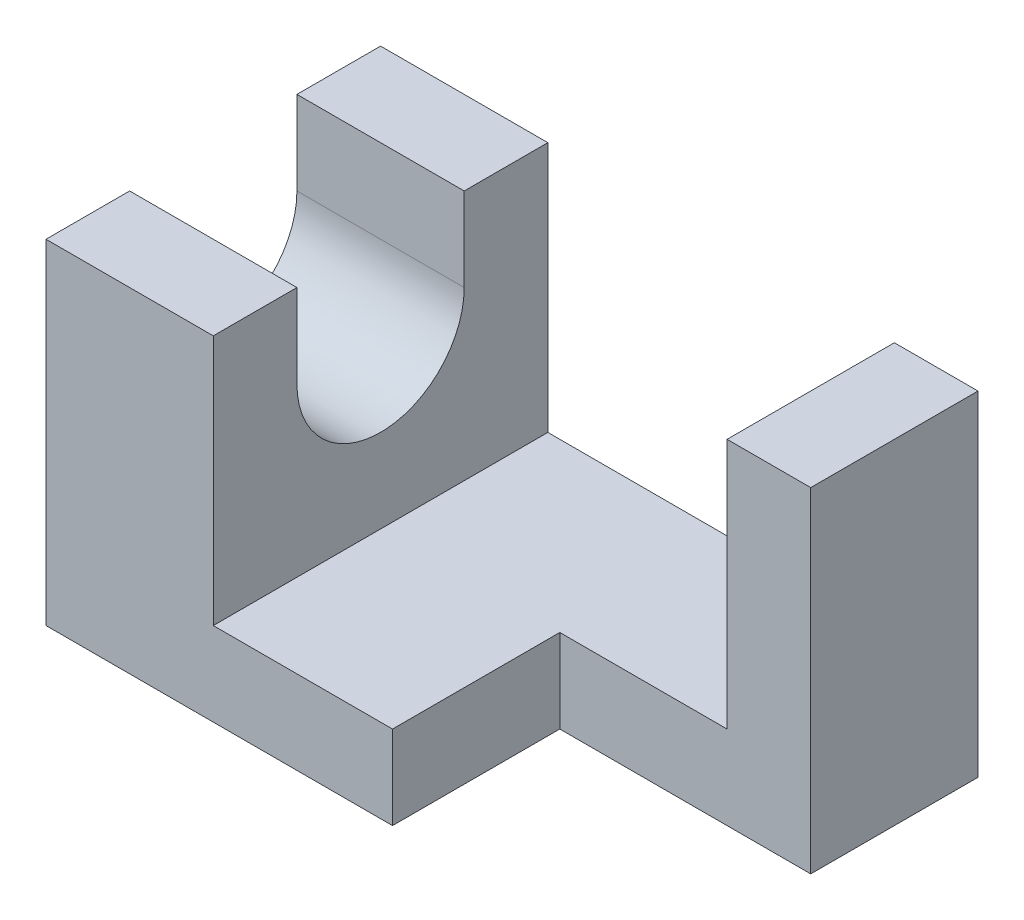
ISO-10303-21;
HEADER;
FILE_DESCRIPTION(('STEP AP214'),'2;1');
FILE_NAME('part.step','',(''),(''),'','','');
FILE_SCHEMA(('AUTOMOTIVE_DESIGN { 1 0 10303 214 1 1 1 1 }'));
ENDSEC;
DATA;
#1=APPLICATION_CONTEXT('core data for automotive mechanical design processes');
#2=APPLICATION_PROTOCOL_DEFINITION('international standard','automotive_design',2000,#1);
#3=PRODUCT_CONTEXT('',#1,'mechanical');
#4=PRODUCT('Part','Part','',(#3));
#5=PRODUCT_RELATED_PRODUCT_CATEGORY('part','',(#4));
#6=PRODUCT_DEFINITION_FORMATION('','',#4);
#7=PRODUCT_DEFINITION_CONTEXT('part definition',#1,'design');
#8=PRODUCT_DEFINITION('design','',#6,#7);
#9=PRODUCT_DEFINITION_SHAPE('','',#8);
#10=(LENGTH_UNIT() NAMED_UNIT(*) SI_UNIT(.MILLI.,.METRE.));
#11=(NAMED_UNIT(*) PLANE_ANGLE_UNIT() SI_UNIT($,.RADIAN.));
#12=(NAMED_UNIT(*) SI_UNIT($,.STERADIAN.) SOLID_ANGLE_UNIT());
#13=UNCERTAINTY_MEASURE_WITH_UNIT(LENGTH_MEASURE(1.E-05),#10,'distance_accuracy_value','');
#14=(GEOMETRIC_REPRESENTATION_CONTEXT(3) GLOBAL_UNCERTAINTY_ASSIGNED_CONTEXT((#13)) GLOBAL_UNIT_ASSIGNED_CONTEXT((#10,
#11,#12)) REPRESENTATION_CONTEXT('',''));
#15=CARTESIAN_POINT('',(0.,0.,0.));
#16=DIRECTION('',(0.,0.,1.));
#17=DIRECTION('',(1.,0.,0.));
#18=AXIS2_PLACEMENT_3D('',#15,#16,#17);
#19=CARTESIAN_POINT('',(0.,28.,0.));
#20=DIRECTION('',(0.,1.,0.));
#21=DIRECTION('',(0.,0.,1.));
#22=AXIS2_PLACEMENT_3D('',#19,#20,#21);
#23=PLANE('',#22);
#24=DIRECTION('',(0.,0.,-1.));
#25=VECTOR('',#24,1.);
#26=CARTESIAN_POINT('',(-29.,28.,0.));
#27=LINE('',#26,#25);
#28=CARTESIAN_POINT('',(-29.,28.,-21.));
#29=VERTEX_POINT('',#28);
#30=CARTESIAN_POINT('',(-29.,28.,-28.));
#31=VERTEX_POINT('',#30);
#32=EDGE_CURVE('E146',#29,#31,#27,.T.);
#33=ORIENTED_EDGE('',*,*,#32,.F.);
#34=DIRECTION('',(1.,0.,0.));
#35=VECTOR('',#34,1.);
#36=CARTESIAN_POINT('',(0.,28.,-21.));
#37=LINE('',#36,#35);
#38=CARTESIAN_POINT('',(-15.,28.,-21.));
#39=VERTEX_POINT('',#38);
#40=EDGE_CURVE('E200',#29,#39,#37,.T.);
#41=ORIENTED_EDGE('',*,*,#40,.T.);
#42=DIRECTION('',(0.,0.,1.));
#43=VECTOR('',#42,1.);
#44=CARTESIAN_POINT('',(-15.,28.,0.));
#45=LINE('',#44,#43);
#46=CARTESIAN_POINT('',(-15.,28.,-28.));
#47=VERTEX_POINT('',#46);
#48=EDGE_CURVE('E139',#47,#39,#45,.T.);
#49=ORIENTED_EDGE('',*,*,#48,.F.);
#50=DIRECTION('',(1.,0.,0.));
#51=VECTOR('',#50,1.);
#52=CARTESIAN_POINT('',(0.,28.,-28.));
#53=LINE('',#52,#51);
#54=EDGE_CURVE('E142',#31,#47,#53,.T.);
#55=ORIENTED_EDGE('',*,*,#54,.F.);
#56=EDGE_LOOP('',(#33,#41,#49,#55));
#57=FACE_BOUND('',#56,.T.);
#58=ADVANCED_FACE('F43',(#57),#23,.T.);
#59=CARTESIAN_POINT('',(0.,7.,-28.));
#60=DIRECTION('',(0.,0.,-1.));
#61=DIRECTION('',(-1.,0.,0.));
#62=AXIS2_PLACEMENT_3D('',#59,#60,#61);
#63=PLANE('',#62);
#64=DIRECTION('',(1.,0.,0.));
#65=VECTOR('',#64,1.);
#66=CARTESIAN_POINT('',(0.,0.,-28.));
#67=LINE('',#66,#65);
#68=CARTESIAN_POINT('',(-29.,0.,-28.));
#69=VERTEX_POINT('',#68);
#70=CARTESIAN_POINT('',(21.,0.,-28.));
#71=VERTEX_POINT('',#70);
#72=EDGE_CURVE('E165',#69,#71,#67,.T.);
#73=ORIENTED_EDGE('',*,*,#72,.F.);
#74=DIRECTION('',(0.,-1.,0.));
#75=VECTOR('',#74,1.);
#76=CARTESIAN_POINT('',(-29.,28.,-28.));
#77=LINE('',#76,#75);
#78=EDGE_CURVE('E159',#31,#69,#77,.T.);
#79=ORIENTED_EDGE('',*,*,#78,.F.);
#80=ORIENTED_EDGE('',*,*,#54,.T.);
#81=DIRECTION('',(0.,-1.,0.));
#82=VECTOR('',#81,1.);
#83=CARTESIAN_POINT('',(-15.,28.,-28.));
#84=LINE('',#83,#82);
#85=CARTESIAN_POINT('',(-15.,7.,-28.));
#86=VERTEX_POINT('',#85);
#87=EDGE_CURVE('E162',#47,#86,#84,.T.);
#88=ORIENTED_EDGE('',*,*,#87,.T.);
#89=DIRECTION('',(1.,0.,0.));
#90=VECTOR('',#89,1.);
#91=CARTESIAN_POINT('',(0.,7.,-28.));
#92=LINE('',#91,#90);
#93=CARTESIAN_POINT('',(14.,7.,-28.));
#94=VERTEX_POINT('',#93);
#95=EDGE_CURVE('E166',#86,#94,#92,.T.);
#96=ORIENTED_EDGE('',*,*,#95,.T.);
#97=DIRECTION('',(0.,-1.,0.));
#98=VECTOR('',#97,1.);
#99=CARTESIAN_POINT('',(14.,28.,-28.));
#100=LINE('',#99,#98);
#101=CARTESIAN_POINT('',(14.,28.,-28.));
#102=VERTEX_POINT('',#101);
#103=EDGE_CURVE('E135',#102,#94,#100,.T.);
#104=ORIENTED_EDGE('',*,*,#103,.F.);
#105=DIRECTION('',(1.,0.,0.));
#106=VECTOR('',#105,1.);
#107=CARTESIAN_POINT('',(0.,28.,-28.));
#108=LINE('',#107,#106);
#109=CARTESIAN_POINT('',(21.,28.,-28.));
#110=VERTEX_POINT('',#109);
#111=EDGE_CURVE('E112',#102,#110,#108,.T.);
#112=ORIENTED_EDGE('',*,*,#111,.T.);
#113=DIRECTION('',(0.,-1.,0.));
#114=VECTOR('',#113,1.);
#115=CARTESIAN_POINT('',(21.,28.,-28.));
#116=LINE('',#115,#114);
#117=EDGE_CURVE('E124',#110,#71,#116,.T.);
#118=ORIENTED_EDGE('',*,*,#117,.T.);
#119=EDGE_LOOP('',(#73,#79,#80,#88,#96,#104,#112,#118));
#120=FACE_BOUND('',#119,.T.);
#121=ADVANCED_FACE('F45',(#120),#63,.T.);
#122=CARTESIAN_POINT('',(0.,7.,0.));
#123=DIRECTION('',(0.,0.,1.));
#124=DIRECTION('',(1.,0.,0.));
#125=AXIS2_PLACEMENT_3D('',#122,#123,#124);
#126=PLANE('',#125);
#127=DIRECTION('',(-1.,0.,0.));
#128=VECTOR('',#127,1.);
#129=CARTESIAN_POINT('',(0.,0.,0.));
#130=LINE('',#129,#128);
#131=CARTESIAN_POINT('',(0.,0.,0.));
#132=VERTEX_POINT('',#131);
#133=CARTESIAN_POINT('',(-29.,0.,0.));
#134=VERTEX_POINT('',#133);
#135=EDGE_CURVE('E187',#132,#134,#130,.T.);
#136=ORIENTED_EDGE('',*,*,#135,.F.);
#137=DIRECTION('',(0.,-1.,0.));
#138=VECTOR('',#137,1.);
#139=CARTESIAN_POINT('',(0.,7.,0.));
#140=LINE('',#139,#138);
#141=CARTESIAN_POINT('',(0.,7.,0.));
#142=VERTEX_POINT('',#141);
#143=EDGE_CURVE('E197',#142,#132,#140,.T.);
#144=ORIENTED_EDGE('',*,*,#143,.F.);
#145=DIRECTION('',(-1.,0.,0.));
#146=VECTOR('',#145,1.);
#147=CARTESIAN_POINT('',(0.,7.,0.));
#148=LINE('',#147,#146);
#149=CARTESIAN_POINT('',(-15.,7.,0.));
#150=VERTEX_POINT('',#149);
#151=EDGE_CURVE('E172',#142,#150,#148,.T.);
#152=ORIENTED_EDGE('',*,*,#151,.T.);
#153=DIRECTION('',(0.,-1.,0.));
#154=VECTOR('',#153,1.);
#155=CARTESIAN_POINT('',(-15.,28.,0.));
#156=LINE('',#155,#154);
#157=CARTESIAN_POINT('',(-15.,28.,0.));
#158=VERTEX_POINT('',#157);
#159=EDGE_CURVE('E151',#158,#150,#156,.T.);
#160=ORIENTED_EDGE('',*,*,#159,.F.);
#161=DIRECTION('',(-1.,0.,0.));
#162=VECTOR('',#161,1.);
#163=CARTESIAN_POINT('',(0.,28.,0.));
#164=LINE('',#163,#162);
#165=CARTESIAN_POINT('',(-29.,28.,0.));
#166=VERTEX_POINT('',#165);
#167=EDGE_CURVE('E148',#158,#166,#164,.T.);
#168=ORIENTED_EDGE('',*,*,#167,.T.);
#169=DIRECTION('',(0.,-1.,0.));
#170=VECTOR('',#169,1.);
#171=CARTESIAN_POINT('',(-29.,28.,0.));
#172=LINE('',#171,#170);
#173=EDGE_CURVE('E156',#166,#134,#172,.T.);
#174=ORIENTED_EDGE('',*,*,#173,.T.);
#175=EDGE_LOOP('',(#136,#144,#152,#160,#168,#174));
#176=FACE_BOUND('',#175,.T.);
#177=ADVANCED_FACE('F218',(#176),#126,.T.);
#178=CARTESIAN_POINT('',(0.,7.,0.));
#179=DIRECTION('',(1.,0.,0.));
#180=DIRECTION('',(0.,0.,-1.));
#181=AXIS2_PLACEMENT_3D('',#178,#179,#180);
#182=PLANE('',#181);
#183=DIRECTION('',(0.,0.,1.));
#184=VECTOR('',#183,1.);
#185=CARTESIAN_POINT('',(0.,0.,0.));
#186=LINE('',#185,#184);
#187=CARTESIAN_POINT('',(0.,0.,-14.));
#188=VERTEX_POINT('',#187);
#189=EDGE_CURVE('E190',#188,#132,#186,.T.);
#190=ORIENTED_EDGE('',*,*,#189,.F.);
#191=DIRECTION('',(0.,-1.,0.));
#192=VECTOR('',#191,1.);
#193=CARTESIAN_POINT('',(0.,7.,-14.));
#194=LINE('',#193,#192);
#195=CARTESIAN_POINT('',(0.,7.,-14.));
#196=VERTEX_POINT('',#195);
#197=EDGE_CURVE('E184',#196,#188,#194,.T.);
#198=ORIENTED_EDGE('',*,*,#197,.F.);
#199=DIRECTION('',(0.,0.,1.));
#200=VECTOR('',#199,1.);
#201=CARTESIAN_POINT('',(0.,7.,0.));
#202=LINE('',#201,#200);
#203=EDGE_CURVE('E175',#196,#142,#202,.T.);
#204=ORIENTED_EDGE('',*,*,#203,.T.);
#205=ORIENTED_EDGE('',*,*,#143,.T.);
#206=EDGE_LOOP('',(#190,#198,#204,#205));
#207=FACE_BOUND('',#206,.T.);
#208=ADVANCED_FACE('F250',(#207),#182,.T.);
#209=CARTESIAN_POINT('',(0.,7.,-14.));
#210=DIRECTION('',(0.,0.,1.));
#211=DIRECTION('',(1.,0.,0.));
#212=AXIS2_PLACEMENT_3D('',#209,#210,#211);
#213=PLANE('',#212);
#214=DIRECTION('',(-1.,0.,0.));
#215=VECTOR('',#214,1.);
#216=CARTESIAN_POINT('',(0.,0.,-14.));
#217=LINE('',#216,#215);
#218=CARTESIAN_POINT('',(21.,0.,-14.));
#219=VERTEX_POINT('',#218);
#220=EDGE_CURVE('E169',#219,#188,#217,.T.);
#221=ORIENTED_EDGE('',*,*,#220,.F.);
#222=DIRECTION('',(0.,-1.,0.));
#223=VECTOR('',#222,1.);
#224=CARTESIAN_POINT('',(21.,28.,-14.));
#225=LINE('',#224,#223);
#226=CARTESIAN_POINT('',(21.,28.,-14.));
#227=VERTEX_POINT('',#226);
#228=EDGE_CURVE('E129',#227,#219,#225,.T.);
#229=ORIENTED_EDGE('',*,*,#228,.F.);
#230=DIRECTION('',(-1.,0.,0.));
#231=VECTOR('',#230,1.);
#232=CARTESIAN_POINT('',(0.,28.,-14.));
#233=LINE('',#232,#231);
#234=CARTESIAN_POINT('',(14.,28.,-14.));
#235=VERTEX_POINT('',#234);
#236=EDGE_CURVE('E118',#227,#235,#233,.T.);
#237=ORIENTED_EDGE('',*,*,#236,.T.);
#238=DIRECTION('',(0.,-1.,0.));
#239=VECTOR('',#238,1.);
#240=CARTESIAN_POINT('',(14.,28.,-14.));
#241=LINE('',#240,#239);
#242=CARTESIAN_POINT('',(14.,7.,-14.));
#243=VERTEX_POINT('',#242);
#244=EDGE_CURVE('E132',#235,#243,#241,.T.);
#245=ORIENTED_EDGE('',*,*,#244,.T.);
#246=DIRECTION('',(-1.,0.,0.));
#247=VECTOR('',#246,1.);
#248=CARTESIAN_POINT('',(0.,7.,-14.));
#249=LINE('',#248,#247);
#250=EDGE_CURVE('E178',#243,#196,#249,.T.);
#251=ORIENTED_EDGE('',*,*,#250,.T.);
#252=ORIENTED_EDGE('',*,*,#197,.T.);
#253=EDGE_LOOP('',(#221,#229,#237,#245,#251,#252));
#254=FACE_BOUND('',#253,.T.);
#255=ADVANCED_FACE('F246',(#254),#213,.T.);
#256=CARTESIAN_POINT('',(0.,7.,0.));
#257=DIRECTION('',(0.,1.,0.));
#258=DIRECTION('',(0.,0.,1.));
#259=AXIS2_PLACEMENT_3D('',#256,#257,#258);
#260=PLANE('',#259);
#261=ORIENTED_EDGE('',*,*,#95,.F.);
#262=DIRECTION('',(0.,0.,1.));
#263=VECTOR('',#262,1.);
#264=CARTESIAN_POINT('',(-15.,7.,0.));
#265=LINE('',#264,#263);
#266=EDGE_CURVE('E168',#86,#150,#265,.T.);
#267=ORIENTED_EDGE('',*,*,#266,.T.);
#268=ORIENTED_EDGE('',*,*,#151,.F.);
#269=ORIENTED_EDGE('',*,*,#203,.F.);
#270=ORIENTED_EDGE('',*,*,#250,.F.);
#271=DIRECTION('',(0.,0.,1.));
#272=VECTOR('',#271,1.);
#273=CARTESIAN_POINT('',(14.,7.,0.));
#274=LINE('',#273,#272);
#275=EDGE_CURVE('E181',#94,#243,#274,.T.);
#276=ORIENTED_EDGE('',*,*,#275,.F.);
#277=EDGE_LOOP('',(#261,#267,#268,#269,#270,#276));
#278=FACE_BOUND('',#277,.T.);
#279=ADVANCED_FACE('F277',(#278),#260,.T.);
#280=CARTESIAN_POINT('',(0.,0.,0.));
#281=DIRECTION('',(0.,1.,0.));
#282=DIRECTION('',(0.,0.,1.));
#283=AXIS2_PLACEMENT_3D('',#280,#281,#282);
#284=PLANE('',#283);
#285=ORIENTED_EDGE('',*,*,#72,.T.);
#286=DIRECTION('',(0.,0.,1.));
#287=VECTOR('',#286,1.);
#288=CARTESIAN_POINT('',(21.,0.,0.));
#289=LINE('',#288,#287);
#290=EDGE_CURVE('E111',#71,#219,#289,.T.);
#291=ORIENTED_EDGE('',*,*,#290,.T.);
#292=ORIENTED_EDGE('',*,*,#220,.T.);
#293=ORIENTED_EDGE('',*,*,#189,.T.);
#294=ORIENTED_EDGE('',*,*,#135,.T.);
#295=DIRECTION('',(0.,0.,-1.));
#296=VECTOR('',#295,1.);
#297=CARTESIAN_POINT('',(-29.,0.,0.));
#298=LINE('',#297,#296);
#299=EDGE_CURVE('E138',#134,#69,#298,.T.);
#300=ORIENTED_EDGE('',*,*,#299,.T.);
#301=EDGE_LOOP('',(#285,#291,#292,#293,#294,#300));
#302=FACE_BOUND('',#301,.T.);
#303=ADVANCED_FACE('F252',(#302),#284,.F.);
#304=CARTESIAN_POINT('',(-15.,28.,0.));
#305=DIRECTION('',(1.,0.,0.));
#306=DIRECTION('',(0.,0.,-1.));
#307=AXIS2_PLACEMENT_3D('',#304,#305,#306);
#308=PLANE('',#307);
#309=DIRECTION('',(0.,-1.,0.));
#310=VECTOR('',#309,1.);
#311=CARTESIAN_POINT('',(-15.,28.,-6.99999999999999));
#312=LINE('',#311,#310);
#313=CARTESIAN_POINT('',(-15.,28.,-7.));
#314=VERTEX_POINT('',#313);
#315=CARTESIAN_POINT('',(-15.,21.,-7.));
#316=VERTEX_POINT('',#315);
#317=EDGE_CURVE('E90',#314,#316,#312,.T.);
#318=ORIENTED_EDGE('',*,*,#317,.F.);
#319=EDGE_CURVE('E143',#314,#158,#45,.T.);
#320=ORIENTED_EDGE('',*,*,#319,.T.);
#321=ORIENTED_EDGE('',*,*,#159,.T.);
#322=ORIENTED_EDGE('',*,*,#266,.F.);
#323=ORIENTED_EDGE('',*,*,#87,.F.);
#324=ORIENTED_EDGE('',*,*,#48,.T.);
#325=DIRECTION('',(0.,-1.,0.));
#326=VECTOR('',#325,1.);
#327=CARTESIAN_POINT('',(-15.,28.,-21.));
#328=LINE('',#327,#326);
#329=CARTESIAN_POINT('',(-15.,21.,-21.));
#330=VERTEX_POINT('',#329);
#331=EDGE_CURVE('E60',#39,#330,#328,.T.);
#332=ORIENTED_EDGE('',*,*,#331,.T.);
#333=CARTESIAN_POINT('',(-15.,21.,-14.));
#334=DIRECTION('',(1.,0.,0.));
#335=DIRECTION('',(0.,0.,-1.));
#336=AXIS2_PLACEMENT_3D('',#333,#334,#335);
#337=CIRCLE('',#336,6.99999999999999);
#338=EDGE_CURVE('E105',#316,#330,#337,.T.);
#339=ORIENTED_EDGE('',*,*,#338,.F.);
#340=EDGE_LOOP('',(#318,#320,#321,#322,#323,#324,#332,#339));
#341=FACE_BOUND('',#340,.T.);
#342=ADVANCED_FACE('F208',(#341),#308,.T.);
#343=CARTESIAN_POINT('',(-29.,28.,0.));
#344=DIRECTION('',(-1.,0.,0.));
#345=DIRECTION('',(0.,0.,1.));
#346=AXIS2_PLACEMENT_3D('',#343,#344,#345);
#347=PLANE('',#346);
#348=DIRECTION('',(0.,1.,0.));
#349=VECTOR('',#348,1.);
#350=CARTESIAN_POINT('',(-29.,28.,-6.99999999999999));
#351=LINE('',#350,#349);
#352=CARTESIAN_POINT('',(-29.,21.,-7.));
#353=VERTEX_POINT('',#352);
#354=CARTESIAN_POINT('',(-29.,28.,-7.));
#355=VERTEX_POINT('',#354);
#356=EDGE_CURVE('E86',#353,#355,#351,.T.);
#357=ORIENTED_EDGE('',*,*,#356,.F.);
#358=CARTESIAN_POINT('',(-29.,21.,-14.));
#359=DIRECTION('',(-1.,0.,0.));
#360=DIRECTION('',(0.,0.,1.));
#361=AXIS2_PLACEMENT_3D('',#358,#359,#360);
#362=CIRCLE('',#361,6.99999999999999);
#363=CARTESIAN_POINT('',(-29.,21.,-21.));
#364=VERTEX_POINT('',#363);
#365=EDGE_CURVE('E11',#364,#353,#362,.T.);
#366=ORIENTED_EDGE('',*,*,#365,.F.);
#367=DIRECTION('',(0.,1.,0.));
#368=VECTOR('',#367,1.);
#369=CARTESIAN_POINT('',(-29.,28.,-21.));
#370=LINE('',#369,#368);
#371=EDGE_CURVE('E72',#364,#29,#370,.T.);
#372=ORIENTED_EDGE('',*,*,#371,.T.);
#373=ORIENTED_EDGE('',*,*,#32,.T.);
#374=ORIENTED_EDGE('',*,*,#78,.T.);
#375=ORIENTED_EDGE('',*,*,#299,.F.);
#376=ORIENTED_EDGE('',*,*,#173,.F.);
#377=EDGE_CURVE('E103',#166,#355,#27,.T.);
#378=ORIENTED_EDGE('',*,*,#377,.T.);
#379=EDGE_LOOP('',(#357,#366,#372,#373,#374,#375,#376,#378));
#380=FACE_BOUND('',#379,.T.);
#381=ADVANCED_FACE('F100',(#380),#347,.T.);
#382=DIRECTION('',(1.,0.,0.));
#383=VECTOR('',#382,1.);
#384=CARTESIAN_POINT('',(0.,28.,-6.99999999999999));
#385=LINE('',#384,#383);
#386=EDGE_CURVE('E52',#355,#314,#385,.T.);
#387=ORIENTED_EDGE('',*,*,#386,.F.);
#388=ORIENTED_EDGE('',*,*,#377,.F.);
#389=ORIENTED_EDGE('',*,*,#167,.F.);
#390=ORIENTED_EDGE('',*,*,#319,.F.);
#391=EDGE_LOOP('',(#387,#388,#389,#390));
#392=FACE_BOUND('',#391,.T.);
#393=ADVANCED_FACE('F212',(#392),#23,.T.);
#394=CARTESIAN_POINT('',(14.,28.,0.));
#395=DIRECTION('',(1.,0.,0.));
#396=DIRECTION('',(0.,0.,-1.));
#397=AXIS2_PLACEMENT_3D('',#394,#395,#396);
#398=PLANE('',#397);
#399=ORIENTED_EDGE('',*,*,#103,.T.);
#400=ORIENTED_EDGE('',*,*,#275,.T.);
#401=ORIENTED_EDGE('',*,*,#244,.F.);
#402=DIRECTION('',(0.,0.,1.));
#403=VECTOR('',#402,1.);
#404=CARTESIAN_POINT('',(14.,28.,0.));
#405=LINE('',#404,#403);
#406=EDGE_CURVE('E115',#102,#235,#405,.T.);
#407=ORIENTED_EDGE('',*,*,#406,.F.);
#408=EDGE_LOOP('',(#399,#400,#401,#407));
#409=FACE_BOUND('',#408,.T.);
#410=ADVANCED_FACE('F284',(#409),#398,.F.);
#411=CARTESIAN_POINT('',(21.,28.,0.));
#412=DIRECTION('',(1.,0.,0.));
#413=DIRECTION('',(0.,0.,-1.));
#414=AXIS2_PLACEMENT_3D('',#411,#412,#413);
#415=PLANE('',#414);
#416=ORIENTED_EDGE('',*,*,#290,.F.);
#417=ORIENTED_EDGE('',*,*,#117,.F.);
#418=DIRECTION('',(0.,0.,1.));
#419=VECTOR('',#418,1.);
#420=CARTESIAN_POINT('',(21.,28.,0.));
#421=LINE('',#420,#419);
#422=EDGE_CURVE('E121',#110,#227,#421,.T.);
#423=ORIENTED_EDGE('',*,*,#422,.T.);
#424=ORIENTED_EDGE('',*,*,#228,.T.);
#425=EDGE_LOOP('',(#416,#417,#423,#424));
#426=FACE_BOUND('',#425,.T.);
#427=ADVANCED_FACE('F258',(#426),#415,.T.);
#428=CARTESIAN_POINT('',(0.,28.,0.));
#429=DIRECTION('',(0.,1.,0.));
#430=DIRECTION('',(0.,0.,1.));
#431=AXIS2_PLACEMENT_3D('',#428,#429,#430);
#432=PLANE('',#431);
#433=ORIENTED_EDGE('',*,*,#111,.F.);
#434=ORIENTED_EDGE('',*,*,#406,.T.);
#435=ORIENTED_EDGE('',*,*,#236,.F.);
#436=ORIENTED_EDGE('',*,*,#422,.F.);
#437=EDGE_LOOP('',(#433,#434,#435,#436));
#438=FACE_BOUND('',#437,.T.);
#439=ADVANCED_FACE('F287',(#438),#432,.T.);
#440=CARTESIAN_POINT('',(-29.000012,0.,-7.00000000000002));
#441=DIRECTION('',(0.,0.,1.));
#442=DIRECTION('',(0.,-1.,0.));
#443=AXIS2_PLACEMENT_3D('',#440,#441,#442);
#444=PLANE('',#443);
#445=ORIENTED_EDGE('',*,*,#317,.T.);
#446=DIRECTION('',(-1.,0.,0.));
#447=VECTOR('',#446,1.);
#448=CARTESIAN_POINT('',(-1.,21.,-7.));
#449=LINE('',#448,#447);
#450=EDGE_CURVE('E81',#316,#353,#449,.T.);
#451=ORIENTED_EDGE('',*,*,#450,.T.);
#452=ORIENTED_EDGE('',*,*,#356,.T.);
#453=ORIENTED_EDGE('',*,*,#386,.T.);
#454=EDGE_LOOP('',(#445,#451,#452,#453));
#455=FACE_BOUND('',#454,.T.);
#456=ADVANCED_FACE('F82',(#455),#444,.F.);
#457=CARTESIAN_POINT('',(-29.000012,0.,-21.));
#458=DIRECTION('',(0.,0.,1.));
#459=DIRECTION('',(0.,-1.,0.));
#460=AXIS2_PLACEMENT_3D('',#457,#458,#459);
#461=PLANE('',#460);
#462=ORIENTED_EDGE('',*,*,#40,.F.);
#463=ORIENTED_EDGE('',*,*,#371,.F.);
#464=DIRECTION('',(-1.,0.,0.));
#465=VECTOR('',#464,1.);
#466=CARTESIAN_POINT('',(-1.,21.,-21.));
#467=LINE('',#466,#465);
#468=EDGE_CURVE('E94',#330,#364,#467,.T.);
#469=ORIENTED_EDGE('',*,*,#468,.F.);
#470=ORIENTED_EDGE('',*,*,#331,.F.);
#471=EDGE_LOOP('',(#462,#463,#469,#470));
#472=FACE_BOUND('',#471,.T.);
#473=ADVANCED_FACE('F294',(#472),#461,.T.);
#474=CARTESIAN_POINT('',(-1.,21.,-14.));
#475=DIRECTION('',(-1.,0.,0.));
#476=DIRECTION('',(0.,0.,1.));
#477=AXIS2_PLACEMENT_3D('',#474,#475,#476);
#478=CYLINDRICAL_SURFACE('',#477,6.99999999999999);
#479=ORIENTED_EDGE('',*,*,#338,.T.);
#480=ORIENTED_EDGE('',*,*,#468,.T.);
#481=ORIENTED_EDGE('',*,*,#365,.T.);
#482=ORIENTED_EDGE('',*,*,#450,.F.);
#483=EDGE_LOOP('',(#479,#480,#481,#482));
#484=FACE_BOUND('',#483,.T.);
#485=ADVANCED_FACE('F97',(#484),#478,.F.);
#486=CLOSED_SHELL('',(#58,#121,#177,#208,#255,#279,#303,#342,#381,#393,#410,#427,#439,#456,#473,#485));
#487=MANIFOLD_SOLID_BREP('B2',#486);
#488=ADVANCED_BREP_SHAPE_REPRESENTATION('',(#18,#487),#14);
#489=SHAPE_DEFINITION_REPRESENTATION(#9,#488);
ENDSEC;
END-ISO-10303-21;
